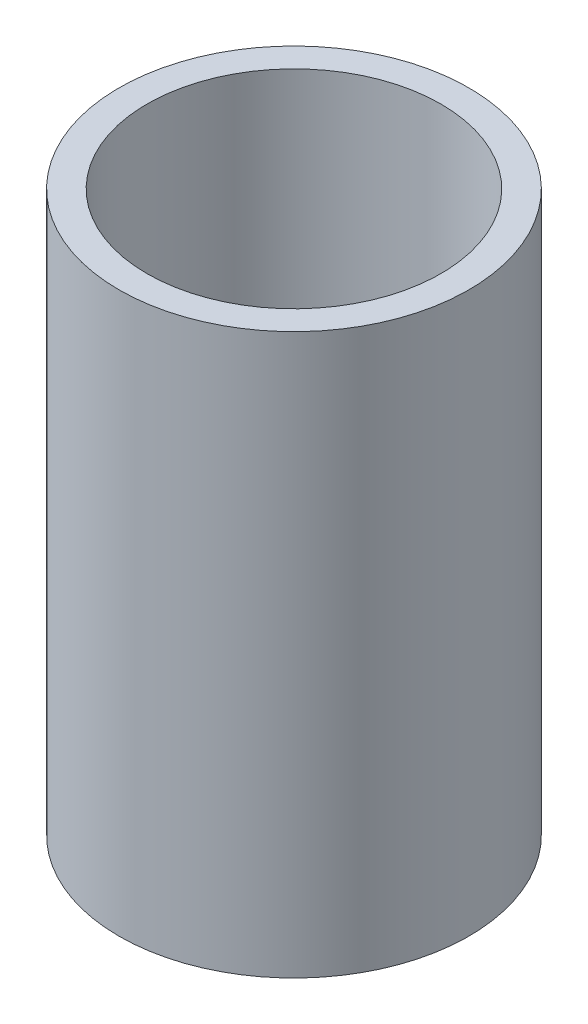
ISO-10303-21;
HEADER;
FILE_DESCRIPTION(('STEP AP214'),'2;1');
FILE_NAME('part.step','',(''),(''),'','','');
FILE_SCHEMA(('AUTOMOTIVE_DESIGN { 1 0 10303 214 1 1 1 1 }'));
ENDSEC;
DATA;
#1=APPLICATION_CONTEXT('core data for automotive mechanical design processes');
#2=APPLICATION_PROTOCOL_DEFINITION('international standard','automotive_design',2000,#1);
#3=PRODUCT_CONTEXT('',#1,'mechanical');
#4=PRODUCT('Part','Part','',(#3));
#5=PRODUCT_RELATED_PRODUCT_CATEGORY('part','',(#4));
#6=PRODUCT_DEFINITION_FORMATION('','',#4);
#7=PRODUCT_DEFINITION_CONTEXT('part definition',#1,'design');
#8=PRODUCT_DEFINITION('design','',#6,#7);
#9=PRODUCT_DEFINITION_SHAPE('','',#8);
#10=(LENGTH_UNIT() NAMED_UNIT(*) SI_UNIT(.MILLI.,.METRE.));
#11=(NAMED_UNIT(*) PLANE_ANGLE_UNIT() SI_UNIT($,.RADIAN.));
#12=(NAMED_UNIT(*) SI_UNIT($,.STERADIAN.) SOLID_ANGLE_UNIT());
#13=UNCERTAINTY_MEASURE_WITH_UNIT(LENGTH_MEASURE(1.E-05),#10,'distance_accuracy_value','');
#14=(GEOMETRIC_REPRESENTATION_CONTEXT(3) GLOBAL_UNCERTAINTY_ASSIGNED_CONTEXT((#13)) GLOBAL_UNIT_ASSIGNED_CONTEXT((#10,
#11,#12)) REPRESENTATION_CONTEXT('',''));
#15=CARTESIAN_POINT('',(0.,0.,0.));
#16=DIRECTION('',(0.,0.,1.));
#17=DIRECTION('',(1.,0.,0.));
#18=AXIS2_PLACEMENT_3D('',#15,#16,#17);
#19=CARTESIAN_POINT('',(0.,40.,0.));
#20=DIRECTION('',(0.,1.,0.));
#21=DIRECTION('',(0.,0.,1.));
#22=AXIS2_PLACEMENT_3D('',#19,#20,#21);
#23=PLANE('',#22);
#24=CARTESIAN_POINT('',(0.,40.,0.));
#25=DIRECTION('',(0.,1.,0.));
#26=DIRECTION('',(0.,0.,1.));
#27=AXIS2_PLACEMENT_3D('',#24,#25,#26);
#28=CIRCLE('',#27,12.5);
#29=CARTESIAN_POINT('',(0.,40.,12.5));
#30=VERTEX_POINT('',#29);
#31=EDGE_CURVE('E10',#30,#30,#28,.T.);
#32=ORIENTED_EDGE('',*,*,#31,.T.);
#33=EDGE_LOOP('',(#32));
#34=FACE_BOUND('',#33,.T.);
#35=CARTESIAN_POINT('',(0.,40.,0.));
#36=DIRECTION('',(0.,1.,0.));
#37=DIRECTION('',(0.,0.,1.));
#38=AXIS2_PLACEMENT_3D('',#35,#36,#37);
#39=CIRCLE('',#38,10.5);
#40=CARTESIAN_POINT('',(0.,40.,10.5));
#41=VERTEX_POINT('',#40);
#42=EDGE_CURVE('E48',#41,#41,#39,.T.);
#43=ORIENTED_EDGE('',*,*,#42,.F.);
#44=EDGE_LOOP('',(#43));
#45=FACE_BOUND('',#44,.T.);
#46=ADVANCED_FACE('F37',(#34,#45),#23,.T.);
#47=CARTESIAN_POINT('',(0.,0.,0.));
#48=DIRECTION('',(0.,1.,0.));
#49=DIRECTION('',(0.,0.,1.));
#50=AXIS2_PLACEMENT_3D('',#47,#48,#49);
#51=PLANE('',#50);
#52=CARTESIAN_POINT('',(0.,0.,0.));
#53=DIRECTION('',(0.,1.,0.));
#54=DIRECTION('',(0.,0.,1.));
#55=AXIS2_PLACEMENT_3D('',#52,#53,#54);
#56=CIRCLE('',#55,12.5);
#57=CARTESIAN_POINT('',(0.,0.,12.5));
#58=VERTEX_POINT('',#57);
#59=EDGE_CURVE('E41',#58,#58,#56,.T.);
#60=ORIENTED_EDGE('',*,*,#59,.F.);
#61=EDGE_LOOP('',(#60));
#62=FACE_BOUND('',#61,.T.);
#63=CARTESIAN_POINT('',(0.,0.,0.));
#64=DIRECTION('',(0.,1.,0.));
#65=DIRECTION('',(0.,0.,1.));
#66=AXIS2_PLACEMENT_3D('',#63,#64,#65);
#67=CIRCLE('',#66,10.5);
#68=CARTESIAN_POINT('',(0.,0.,10.5));
#69=VERTEX_POINT('',#68);
#70=EDGE_CURVE('E50',#69,#69,#67,.T.);
#71=ORIENTED_EDGE('',*,*,#70,.T.);
#72=EDGE_LOOP('',(#71));
#73=FACE_BOUND('',#72,.T.);
#74=ADVANCED_FACE('F60',(#62,#73),#51,.F.);
#75=CARTESIAN_POINT('',(0.,40.,0.));
#76=DIRECTION('',(0.,-1.,0.));
#77=DIRECTION('',(0.,0.,-1.));
#78=AXIS2_PLACEMENT_3D('',#75,#76,#77);
#79=CYLINDRICAL_SURFACE('',#78,12.5);
#80=ORIENTED_EDGE('',*,*,#31,.F.);
#81=EDGE_LOOP('',(#80));
#82=FACE_BOUND('',#81,.T.);
#83=ORIENTED_EDGE('',*,*,#59,.T.);
#84=EDGE_LOOP('',(#83));
#85=FACE_BOUND('',#84,.T.);
#86=ADVANCED_FACE('F39',(#82,#85),#79,.T.);
#87=CARTESIAN_POINT('',(0.,40.,0.));
#88=DIRECTION('',(0.,-1.,0.));
#89=DIRECTION('',(0.,0.,-1.));
#90=AXIS2_PLACEMENT_3D('',#87,#88,#89);
#91=CYLINDRICAL_SURFACE('',#90,10.5);
#92=ORIENTED_EDGE('',*,*,#42,.T.);
#93=EDGE_LOOP('',(#92));
#94=FACE_BOUND('',#93,.T.);
#95=ORIENTED_EDGE('',*,*,#70,.F.);
#96=EDGE_LOOP('',(#95));
#97=FACE_BOUND('',#96,.T.);
#98=ADVANCED_FACE('F56',(#94,#97),#91,.F.);
#99=CLOSED_SHELL('',(#46,#74,#86,#98));
#100=MANIFOLD_SOLID_BREP('B2',#99);
#101=ADVANCED_BREP_SHAPE_REPRESENTATION('',(#18,#100),#14);
#102=SHAPE_DEFINITION_REPRESENTATION(#9,#101);
ENDSEC;
END-ISO-10303-21;
